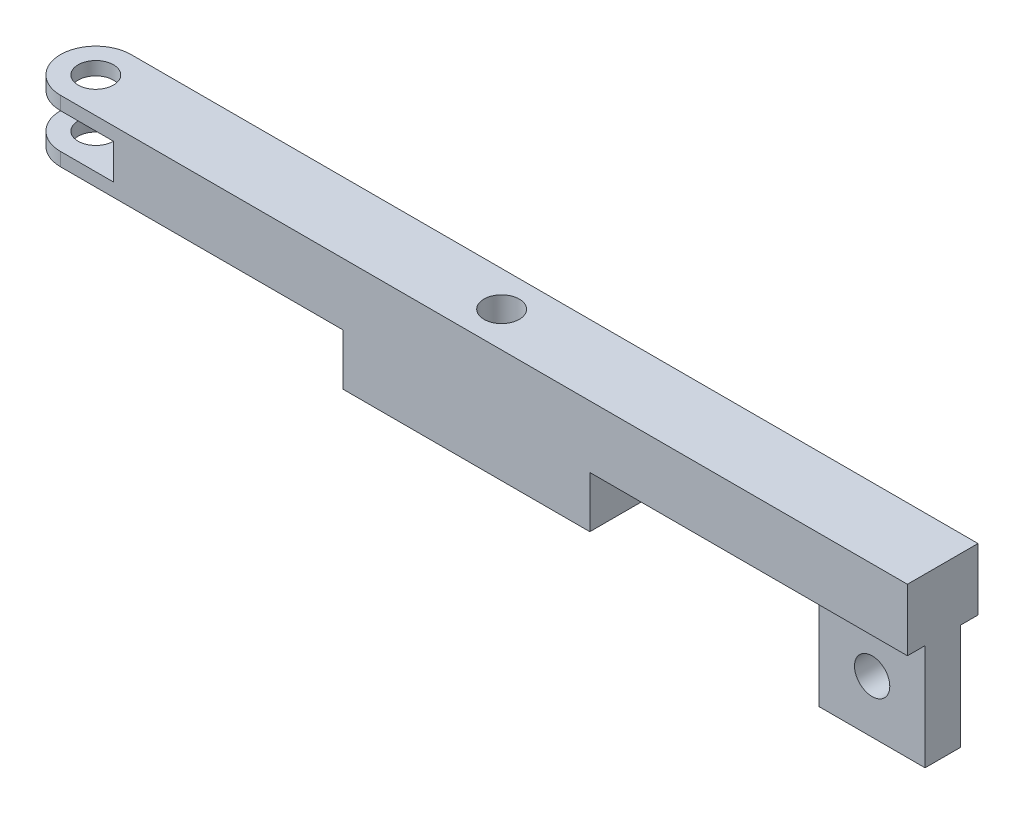
ISO-10303-21;
HEADER;
FILE_DESCRIPTION(('STEP AP214'),'2;1');
FILE_NAME('part.step','',(''),(''),'','','');
FILE_SCHEMA(('AUTOMOTIVE_DESIGN { 1 0 10303 214 1 1 1 1 }'));
ENDSEC;
DATA;
#1=APPLICATION_CONTEXT('core data for automotive mechanical design processes');
#2=APPLICATION_PROTOCOL_DEFINITION('international standard','automotive_design',2000,#1);
#3=PRODUCT_CONTEXT('',#1,'mechanical');
#4=PRODUCT('Part','Part','',(#3));
#5=PRODUCT_RELATED_PRODUCT_CATEGORY('part','',(#4));
#6=PRODUCT_DEFINITION_FORMATION('','',#4);
#7=PRODUCT_DEFINITION_CONTEXT('part definition',#1,'design');
#8=PRODUCT_DEFINITION('design','',#6,#7);
#9=PRODUCT_DEFINITION_SHAPE('','',#8);
#10=(LENGTH_UNIT() NAMED_UNIT(*) SI_UNIT(.MILLI.,.METRE.));
#11=(NAMED_UNIT(*) PLANE_ANGLE_UNIT() SI_UNIT($,.RADIAN.));
#12=(NAMED_UNIT(*) SI_UNIT($,.STERADIAN.) SOLID_ANGLE_UNIT());
#13=UNCERTAINTY_MEASURE_WITH_UNIT(LENGTH_MEASURE(1.E-05),#10,'distance_accuracy_value','');
#14=(GEOMETRIC_REPRESENTATION_CONTEXT(3) GLOBAL_UNCERTAINTY_ASSIGNED_CONTEXT((#13)) GLOBAL_UNIT_ASSIGNED_CONTEXT((#10,
#11,#12)) REPRESENTATION_CONTEXT('',''));
#15=CARTESIAN_POINT('',(0.,0.,0.));
#16=DIRECTION('',(0.,0.,1.));
#17=DIRECTION('',(1.,0.,0.));
#18=AXIS2_PLACEMENT_3D('',#15,#16,#17);
#19=CARTESIAN_POINT('',(-125.,-8.78,20.));
#20=DIRECTION('',(0.,1.,0.));
#21=DIRECTION('',(0.,0.,1.));
#22=AXIS2_PLACEMENT_3D('',#19,#20,#21);
#23=PLANE('',#22);
#24=DIRECTION('',(-1.,0.,0.));
#25=VECTOR('',#24,1.);
#26=CARTESIAN_POINT('',(125.,-8.78,15.));
#27=LINE('',#26,#25);
#28=CARTESIAN_POINT('',(125.,-8.78,15.));
#29=VERTEX_POINT('',#28);
#30=CARTESIAN_POINT('',(95.,-8.78,15.));
#31=VERTEX_POINT('',#30);
#32=EDGE_CURVE('E407',#29,#31,#27,.T.);
#33=ORIENTED_EDGE('',*,*,#32,.F.);
#34=DIRECTION('',(0.,0.,-1.));
#35=VECTOR('',#34,1.);
#36=CARTESIAN_POINT('',(125.,-8.78,20.));
#37=LINE('',#36,#35);
#38=CARTESIAN_POINT('',(125.,-8.78,20.));
#39=VERTEX_POINT('',#38);
#40=EDGE_CURVE('E185',#39,#29,#37,.T.);
#41=ORIENTED_EDGE('',*,*,#40,.F.);
#42=DIRECTION('',(1.,0.,0.));
#43=VECTOR('',#42,1.);
#44=CARTESIAN_POINT('',(-125.,-8.78,20.));
#45=LINE('',#44,#43);
#46=CARTESIAN_POINT('',(35.,-8.78,20.));
#47=VERTEX_POINT('',#46);
#48=EDGE_CURVE('E261',#47,#39,#45,.T.);
#49=ORIENTED_EDGE('',*,*,#48,.F.);
#50=DIRECTION('',(0.,0.,1.));
#51=VECTOR('',#50,1.);
#52=CARTESIAN_POINT('',(35.,-8.78,0.));
#53=LINE('',#52,#51);
#54=CARTESIAN_POINT('',(35.,-8.78,0.));
#55=VERTEX_POINT('',#54);
#56=EDGE_CURVE('E73',#55,#47,#53,.T.);
#57=ORIENTED_EDGE('',*,*,#56,.F.);
#58=DIRECTION('',(1.,0.,0.));
#59=VECTOR('',#58,1.);
#60=CARTESIAN_POINT('',(-125.,-8.78,0.));
#61=LINE('',#60,#59);
#62=CARTESIAN_POINT('',(125.,-8.78,0.));
#63=VERTEX_POINT('',#62);
#64=EDGE_CURVE('E277',#55,#63,#61,.T.);
#65=ORIENTED_EDGE('',*,*,#64,.T.);
#66=CARTESIAN_POINT('',(125.,-8.78,5.));
#67=VERTEX_POINT('',#66);
#68=EDGE_CURVE('E265',#67,#63,#37,.T.);
#69=ORIENTED_EDGE('',*,*,#68,.F.);
#70=DIRECTION('',(1.,0.,0.));
#71=VECTOR('',#70,1.);
#72=CARTESIAN_POINT('',(125.,-8.78,5.));
#73=LINE('',#72,#71);
#74=CARTESIAN_POINT('',(95.,-8.78,5.));
#75=VERTEX_POINT('',#74);
#76=EDGE_CURVE('E179',#75,#67,#73,.T.);
#77=ORIENTED_EDGE('',*,*,#76,.F.);
#78=DIRECTION('',(0.,0.,-1.));
#79=VECTOR('',#78,1.);
#80=CARTESIAN_POINT('',(95.,-8.78,5.));
#81=LINE('',#80,#79);
#82=EDGE_CURVE('E408',#31,#75,#81,.T.);
#83=ORIENTED_EDGE('',*,*,#82,.F.);
#84=EDGE_LOOP('',(#33,#41,#49,#57,#65,#69,#77,#83));
#85=FACE_BOUND('',#84,.T.);
#86=ADVANCED_FACE('F48',(#85),#23,.F.);
#87=CARTESIAN_POINT('',(-115.,-8.78,9.99999999999999));
#88=DIRECTION('',(0.,1.,0.));
#89=DIRECTION('',(0.,0.,1.));
#90=AXIS2_PLACEMENT_3D('',#87,#88,#89);
#91=CIRCLE('',#90,4.99999999999999);
#92=CARTESIAN_POINT('',(-115.,-8.78,15.));
#93=VERTEX_POINT('',#92);
#94=EDGE_CURVE('E222',#93,#93,#91,.T.);
#95=ORIENTED_EDGE('',*,*,#94,.T.);
#96=EDGE_LOOP('',(#95));
#97=FACE_BOUND('',#96,.T.);
#98=DIRECTION('',(0.,0.,-1.));
#99=VECTOR('',#98,1.);
#100=CARTESIAN_POINT('',(-35.,-8.78,0.));
#101=LINE('',#100,#99);
#102=CARTESIAN_POINT('',(-35.,-8.78,20.));
#103=VERTEX_POINT('',#102);
#104=CARTESIAN_POINT('',(-35.,-8.78,0.));
#105=VERTEX_POINT('',#104);
#106=EDGE_CURVE('E198',#103,#105,#101,.T.);
#107=ORIENTED_EDGE('',*,*,#106,.F.);
#108=CARTESIAN_POINT('',(-115.,-8.78,20.));
#109=VERTEX_POINT('',#108);
#110=EDGE_CURVE('E262',#109,#103,#45,.T.);
#111=ORIENTED_EDGE('',*,*,#110,.F.);
#112=CARTESIAN_POINT('',(-115.,-8.78,9.99999999999999));
#113=DIRECTION('',(0.,1.,0.));
#114=DIRECTION('',(0.,0.,1.));
#115=AXIS2_PLACEMENT_3D('',#112,#113,#114);
#116=CIRCLE('',#115,10.);
#117=CARTESIAN_POINT('',(-115.,-8.78,0.));
#118=VERTEX_POINT('',#117);
#119=EDGE_CURVE('E236',#109,#118,#116,.F.);
#120=ORIENTED_EDGE('',*,*,#119,.T.);
#121=EDGE_CURVE('E251',#118,#105,#61,.T.);
#122=ORIENTED_EDGE('',*,*,#121,.T.);
#123=EDGE_LOOP('',(#107,#111,#120,#122));
#124=FACE_BOUND('',#123,.T.);
#125=ADVANCED_FACE('F291',(#97,#124),#23,.F.);
#126=CARTESIAN_POINT('',(-125.,8.78,20.));
#127=DIRECTION('',(0.,-1.,0.));
#128=DIRECTION('',(0.,0.,-1.));
#129=AXIS2_PLACEMENT_3D('',#126,#127,#128);
#130=PLANE('',#129);
#131=CARTESIAN_POINT('',(-115.,8.78,9.99999999999999));
#132=DIRECTION('',(0.,-1.,0.));
#133=DIRECTION('',(0.,0.,-1.));
#134=AXIS2_PLACEMENT_3D('',#131,#132,#133);
#135=CIRCLE('',#134,4.99999999999999);
#136=CARTESIAN_POINT('',(-115.,8.78,5.));
#137=VERTEX_POINT('',#136);
#138=EDGE_CURVE('E229',#137,#137,#135,.T.);
#139=ORIENTED_EDGE('',*,*,#138,.T.);
#140=EDGE_LOOP('',(#139));
#141=FACE_BOUND('',#140,.T.);
#142=CARTESIAN_POINT('',(0.,8.78,10.));
#143=DIRECTION('',(0.,-1.,0.));
#144=DIRECTION('',(0.,0.,-1.));
#145=AXIS2_PLACEMENT_3D('',#142,#143,#144);
#146=CIRCLE('',#145,5.);
#147=CARTESIAN_POINT('',(0.,8.78,5.00000000000003));
#148=VERTEX_POINT('',#147);
#149=EDGE_CURVE('E219',#148,#148,#146,.T.);
#150=ORIENTED_EDGE('',*,*,#149,.T.);
#151=EDGE_LOOP('',(#150));
#152=FACE_BOUND('',#151,.T.);
#153=DIRECTION('',(-1.,0.,0.));
#154=VECTOR('',#153,1.);
#155=CARTESIAN_POINT('',(-125.,8.78,0.));
#156=LINE('',#155,#154);
#157=CARTESIAN_POINT('',(125.,8.78,0.));
#158=VERTEX_POINT('',#157);
#159=CARTESIAN_POINT('',(-115.,8.78,0.));
#160=VERTEX_POINT('',#159);
#161=EDGE_CURVE('E267',#158,#160,#156,.T.);
#162=ORIENTED_EDGE('',*,*,#161,.T.);
#163=CARTESIAN_POINT('',(-115.,8.78,9.99999999999999));
#164=DIRECTION('',(0.,-1.,0.));
#165=DIRECTION('',(0.,0.,-1.));
#166=AXIS2_PLACEMENT_3D('',#163,#164,#165);
#167=CIRCLE('',#166,10.);
#168=CARTESIAN_POINT('',(-115.,8.78,20.));
#169=VERTEX_POINT('',#168);
#170=EDGE_CURVE('E244',#160,#169,#167,.F.);
#171=ORIENTED_EDGE('',*,*,#170,.T.);
#172=DIRECTION('',(-1.,0.,0.));
#173=VECTOR('',#172,1.);
#174=CARTESIAN_POINT('',(-125.,8.78,20.));
#175=LINE('',#174,#173);
#176=CARTESIAN_POINT('',(125.,8.78,20.));
#177=VERTEX_POINT('',#176);
#178=EDGE_CURVE('E250',#177,#169,#175,.T.);
#179=ORIENTED_EDGE('',*,*,#178,.F.);
#180=DIRECTION('',(0.,0.,-1.));
#181=VECTOR('',#180,1.);
#182=CARTESIAN_POINT('',(125.,8.78,20.));
#183=LINE('',#182,#181);
#184=EDGE_CURVE('E286',#177,#158,#183,.T.);
#185=ORIENTED_EDGE('',*,*,#184,.T.);
#186=EDGE_LOOP('',(#162,#171,#179,#185));
#187=FACE_BOUND('',#186,.T.);
#188=ADVANCED_FACE('F343',(#141,#152,#187),#130,.F.);
#189=CARTESIAN_POINT('',(-125.,5.,20.));
#190=DIRECTION('',(0.,1.,0.));
#191=DIRECTION('',(0.,0.,1.));
#192=AXIS2_PLACEMENT_3D('',#189,#190,#191);
#193=PLANE('',#192);
#194=CARTESIAN_POINT('',(-115.,5.,9.99999999999999));
#195=DIRECTION('',(0.,1.,0.));
#196=DIRECTION('',(0.,0.,1.));
#197=AXIS2_PLACEMENT_3D('',#194,#195,#196);
#198=CIRCLE('',#197,4.99999999999999);
#199=CARTESIAN_POINT('',(-115.,5.,15.));
#200=VERTEX_POINT('',#199);
#201=EDGE_CURVE('E226',#200,#200,#198,.T.);
#202=ORIENTED_EDGE('',*,*,#201,.T.);
#203=EDGE_LOOP('',(#202));
#204=FACE_BOUND('',#203,.T.);
#205=DIRECTION('',(1.,0.,0.));
#206=VECTOR('',#205,1.);
#207=CARTESIAN_POINT('',(-125.,5.,20.));
#208=LINE('',#207,#206);
#209=CARTESIAN_POINT('',(-115.,5.,20.));
#210=VERTEX_POINT('',#209);
#211=CARTESIAN_POINT('',(-100.,5.,20.));
#212=VERTEX_POINT('',#211);
#213=EDGE_CURVE('E254',#210,#212,#208,.T.);
#214=ORIENTED_EDGE('',*,*,#213,.F.);
#215=CARTESIAN_POINT('',(-115.,5.,9.99999999999999));
#216=DIRECTION('',(0.,1.,0.));
#217=DIRECTION('',(0.,0.,1.));
#218=AXIS2_PLACEMENT_3D('',#215,#216,#217);
#219=CIRCLE('',#218,10.);
#220=CARTESIAN_POINT('',(-115.,5.,0.));
#221=VERTEX_POINT('',#220);
#222=EDGE_CURVE('E241',#210,#221,#219,.F.);
#223=ORIENTED_EDGE('',*,*,#222,.T.);
#224=DIRECTION('',(1.,0.,0.));
#225=VECTOR('',#224,1.);
#226=CARTESIAN_POINT('',(-125.,5.,0.));
#227=LINE('',#226,#225);
#228=CARTESIAN_POINT('',(-100.,5.,0.));
#229=VERTEX_POINT('',#228);
#230=EDGE_CURVE('E270',#221,#229,#227,.T.);
#231=ORIENTED_EDGE('',*,*,#230,.T.);
#232=DIRECTION('',(0.,0.,-1.));
#233=VECTOR('',#232,1.);
#234=CARTESIAN_POINT('',(-100.,5.,20.));
#235=LINE('',#234,#233);
#236=EDGE_CURVE('E283',#212,#229,#235,.T.);
#237=ORIENTED_EDGE('',*,*,#236,.F.);
#238=EDGE_LOOP('',(#214,#223,#231,#237));
#239=FACE_BOUND('',#238,.T.);
#240=ADVANCED_FACE('F306',(#204,#239),#193,.F.);
#241=CARTESIAN_POINT('',(-125.,-5.,20.));
#242=DIRECTION('',(0.,-1.,0.));
#243=DIRECTION('',(0.,0.,-1.));
#244=AXIS2_PLACEMENT_3D('',#241,#242,#243);
#245=PLANE('',#244);
#246=CARTESIAN_POINT('',(-115.,-5.,9.99999999999999));
#247=DIRECTION('',(0.,-1.,0.));
#248=DIRECTION('',(0.,0.,-1.));
#249=AXIS2_PLACEMENT_3D('',#246,#247,#248);
#250=CIRCLE('',#249,4.99999999999999);
#251=CARTESIAN_POINT('',(-115.,-5.,5.));
#252=VERTEX_POINT('',#251);
#253=EDGE_CURVE('E223',#252,#252,#250,.T.);
#254=ORIENTED_EDGE('',*,*,#253,.T.);
#255=EDGE_LOOP('',(#254));
#256=FACE_BOUND('',#255,.T.);
#257=DIRECTION('',(-1.,0.,0.));
#258=VECTOR('',#257,1.);
#259=CARTESIAN_POINT('',(-125.,-5.,0.));
#260=LINE('',#259,#258);
#261=CARTESIAN_POINT('',(-100.,-5.,0.));
#262=VERTEX_POINT('',#261);
#263=CARTESIAN_POINT('',(-115.,-5.,0.));
#264=VERTEX_POINT('',#263);
#265=EDGE_CURVE('E274',#262,#264,#260,.T.);
#266=ORIENTED_EDGE('',*,*,#265,.T.);
#267=CARTESIAN_POINT('',(-115.,-5.,9.99999999999999));
#268=DIRECTION('',(0.,-1.,0.));
#269=DIRECTION('',(0.,0.,-1.));
#270=AXIS2_PLACEMENT_3D('',#267,#268,#269);
#271=CIRCLE('',#270,10.);
#272=CARTESIAN_POINT('',(-115.,-5.,20.));
#273=VERTEX_POINT('',#272);
#274=EDGE_CURVE('E239',#264,#273,#271,.F.);
#275=ORIENTED_EDGE('',*,*,#274,.T.);
#276=DIRECTION('',(-1.,0.,0.));
#277=VECTOR('',#276,1.);
#278=CARTESIAN_POINT('',(-125.,-5.,20.));
#279=LINE('',#278,#277);
#280=CARTESIAN_POINT('',(-100.,-5.,20.));
#281=VERTEX_POINT('',#280);
#282=EDGE_CURVE('E258',#281,#273,#279,.T.);
#283=ORIENTED_EDGE('',*,*,#282,.F.);
#284=DIRECTION('',(0.,0.,-1.));
#285=VECTOR('',#284,1.);
#286=CARTESIAN_POINT('',(-100.,-5.,20.));
#287=LINE('',#286,#285);
#288=EDGE_CURVE('E280',#281,#262,#287,.T.);
#289=ORIENTED_EDGE('',*,*,#288,.T.);
#290=EDGE_LOOP('',(#266,#275,#283,#289));
#291=FACE_BOUND('',#290,.T.);
#292=ADVANCED_FACE('F302',(#256,#291),#245,.F.);
#293=CARTESIAN_POINT('',(0.,0.,20.));
#294=DIRECTION('',(0.,0.,-1.));
#295=DIRECTION('',(-1.,0.,0.));
#296=AXIS2_PLACEMENT_3D('',#293,#294,#295);
#297=PLANE('',#296);
#298=DIRECTION('',(0.,-1.,0.));
#299=VECTOR('',#298,1.);
#300=CARTESIAN_POINT('',(-115.,25.,20.));
#301=LINE('',#300,#299);
#302=EDGE_CURVE('E232',#273,#109,#301,.T.);
#303=ORIENTED_EDGE('',*,*,#302,.T.);
#304=ORIENTED_EDGE('',*,*,#110,.T.);
#305=DIRECTION('',(0.,1.,0.));
#306=VECTOR('',#305,1.);
#307=CARTESIAN_POINT('',(-35.,-23.33,20.));
#308=LINE('',#307,#306);
#309=CARTESIAN_POINT('',(-35.,-23.33,20.));
#310=VERTEX_POINT('',#309);
#311=EDGE_CURVE('E213',#310,#103,#308,.T.);
#312=ORIENTED_EDGE('',*,*,#311,.F.);
#313=DIRECTION('',(-1.,0.,0.));
#314=VECTOR('',#313,1.);
#315=CARTESIAN_POINT('',(-35.,-23.33,20.));
#316=LINE('',#315,#314);
#317=CARTESIAN_POINT('',(35.,-23.33,20.));
#318=VERTEX_POINT('',#317);
#319=EDGE_CURVE('E197',#318,#310,#316,.T.);
#320=ORIENTED_EDGE('',*,*,#319,.F.);
#321=DIRECTION('',(0.,1.,0.));
#322=VECTOR('',#321,1.);
#323=CARTESIAN_POINT('',(35.,-23.33,20.));
#324=LINE('',#323,#322);
#325=EDGE_CURVE('E216',#318,#47,#324,.T.);
#326=ORIENTED_EDGE('',*,*,#325,.T.);
#327=ORIENTED_EDGE('',*,*,#48,.T.);
#328=DIRECTION('',(0.,1.,0.));
#329=VECTOR('',#328,1.);
#330=CARTESIAN_POINT('',(125.,-8.78,20.));
#331=LINE('',#330,#329);
#332=EDGE_CURVE('E247',#39,#177,#331,.T.);
#333=ORIENTED_EDGE('',*,*,#332,.T.);
#334=ORIENTED_EDGE('',*,*,#178,.T.);
#335=EDGE_CURVE('E235',#169,#210,#301,.T.);
#336=ORIENTED_EDGE('',*,*,#335,.T.);
#337=ORIENTED_EDGE('',*,*,#213,.T.);
#338=DIRECTION('',(0.,-1.,0.));
#339=VECTOR('',#338,1.);
#340=CARTESIAN_POINT('',(-100.,-5.,20.));
#341=LINE('',#340,#339);
#342=EDGE_CURVE('E256',#212,#281,#341,.T.);
#343=ORIENTED_EDGE('',*,*,#342,.T.);
#344=ORIENTED_EDGE('',*,*,#282,.T.);
#345=EDGE_LOOP('',(#303,#304,#312,#320,#326,#327,#333,#334,#336,#337,#343,#344));
#346=FACE_BOUND('',#345,.T.);
#347=ADVANCED_FACE('F305',(#346),#297,.F.);
#348=CARTESIAN_POINT('',(125.,-8.78,20.));
#349=DIRECTION('',(-1.,0.,0.));
#350=DIRECTION('',(0.,0.,1.));
#351=AXIS2_PLACEMENT_3D('',#348,#349,#350);
#352=PLANE('',#351);
#353=DIRECTION('',(0.,1.,0.));
#354=VECTOR('',#353,1.);
#355=CARTESIAN_POINT('',(125.,-8.78,0.));
#356=LINE('',#355,#354);
#357=EDGE_CURVE('E246',#63,#158,#356,.T.);
#358=ORIENTED_EDGE('',*,*,#357,.T.);
#359=ORIENTED_EDGE('',*,*,#184,.F.);
#360=ORIENTED_EDGE('',*,*,#332,.F.);
#361=ORIENTED_EDGE('',*,*,#40,.T.);
#362=DIRECTION('',(0.,1.,0.));
#363=VECTOR('',#362,1.);
#364=CARTESIAN_POINT('',(125.,-38.78,15.));
#365=LINE('',#364,#363);
#366=CARTESIAN_POINT('',(125.,-38.78,15.));
#367=VERTEX_POINT('',#366);
#368=EDGE_CURVE('E167',#367,#29,#365,.T.);
#369=ORIENTED_EDGE('',*,*,#368,.F.);
#370=DIRECTION('',(0.,0.,1.));
#371=VECTOR('',#370,1.);
#372=CARTESIAN_POINT('',(125.,-38.78,5.));
#373=LINE('',#372,#371);
#374=CARTESIAN_POINT('',(125.,-38.78,5.));
#375=VERTEX_POINT('',#374);
#376=EDGE_CURVE('E174',#375,#367,#373,.T.);
#377=ORIENTED_EDGE('',*,*,#376,.F.);
#378=DIRECTION('',(0.,1.,0.));
#379=VECTOR('',#378,1.);
#380=CARTESIAN_POINT('',(125.,-38.78,5.));
#381=LINE('',#380,#379);
#382=EDGE_CURVE('E65',#375,#67,#381,.T.);
#383=ORIENTED_EDGE('',*,*,#382,.T.);
#384=ORIENTED_EDGE('',*,*,#68,.T.);
#385=EDGE_LOOP('',(#358,#359,#360,#361,#369,#377,#383,#384));
#386=FACE_BOUND('',#385,.T.);
#387=ADVANCED_FACE('F50',(#386),#352,.F.);
#388=CARTESIAN_POINT('',(-100.,-5.,20.));
#389=DIRECTION('',(1.,0.,0.));
#390=DIRECTION('',(0.,0.,-1.));
#391=AXIS2_PLACEMENT_3D('',#388,#389,#390);
#392=PLANE('',#391);
#393=DIRECTION('',(0.,-1.,0.));
#394=VECTOR('',#393,1.);
#395=CARTESIAN_POINT('',(-100.,-5.,0.));
#396=LINE('',#395,#394);
#397=EDGE_CURVE('E272',#229,#262,#396,.T.);
#398=ORIENTED_EDGE('',*,*,#397,.T.);
#399=ORIENTED_EDGE('',*,*,#288,.F.);
#400=ORIENTED_EDGE('',*,*,#342,.F.);
#401=ORIENTED_EDGE('',*,*,#236,.T.);
#402=EDGE_LOOP('',(#398,#399,#400,#401));
#403=FACE_BOUND('',#402,.T.);
#404=ADVANCED_FACE('F352',(#403),#392,.F.);
#405=CARTESIAN_POINT('',(0.,0.,0.));
#406=DIRECTION('',(0.,0.,-1.));
#407=DIRECTION('',(-1.,0.,0.));
#408=AXIS2_PLACEMENT_3D('',#405,#406,#407);
#409=PLANE('',#408);
#410=DIRECTION('',(0.,-1.,0.));
#411=VECTOR('',#410,1.);
#412=CARTESIAN_POINT('',(-115.,0.,0.));
#413=LINE('',#412,#411);
#414=EDGE_CURVE('E13',#160,#221,#413,.T.);
#415=ORIENTED_EDGE('',*,*,#414,.F.);
#416=ORIENTED_EDGE('',*,*,#161,.F.);
#417=ORIENTED_EDGE('',*,*,#357,.F.);
#418=ORIENTED_EDGE('',*,*,#64,.F.);
#419=DIRECTION('',(0.,1.,0.));
#420=VECTOR('',#419,1.);
#421=CARTESIAN_POINT('',(35.,-23.33,0.));
#422=LINE('',#421,#420);
#423=CARTESIAN_POINT('',(35.,-23.33,0.));
#424=VERTEX_POINT('',#423);
#425=EDGE_CURVE('E204',#424,#55,#422,.T.);
#426=ORIENTED_EDGE('',*,*,#425,.F.);
#427=DIRECTION('',(1.,0.,0.));
#428=VECTOR('',#427,1.);
#429=CARTESIAN_POINT('',(-35.,-23.33,0.));
#430=LINE('',#429,#428);
#431=CARTESIAN_POINT('',(-35.,-23.33,0.));
#432=VERTEX_POINT('',#431);
#433=EDGE_CURVE('E202',#432,#424,#430,.T.);
#434=ORIENTED_EDGE('',*,*,#433,.F.);
#435=DIRECTION('',(0.,1.,0.));
#436=VECTOR('',#435,1.);
#437=CARTESIAN_POINT('',(-35.,-23.33,0.));
#438=LINE('',#437,#436);
#439=EDGE_CURVE('E210',#432,#105,#438,.T.);
#440=ORIENTED_EDGE('',*,*,#439,.T.);
#441=ORIENTED_EDGE('',*,*,#121,.F.);
#442=EDGE_CURVE('E57',#264,#118,#413,.T.);
#443=ORIENTED_EDGE('',*,*,#442,.F.);
#444=ORIENTED_EDGE('',*,*,#265,.F.);
#445=ORIENTED_EDGE('',*,*,#397,.F.);
#446=ORIENTED_EDGE('',*,*,#230,.F.);
#447=EDGE_LOOP('',(#415,#416,#417,#418,#426,#434,#440,#441,#443,#444,#445,#446));
#448=FACE_BOUND('',#447,.T.);
#449=ADVANCED_FACE('F316',(#448),#409,.T.);
#450=CARTESIAN_POINT('',(-115.,25.,9.99999999999999));
#451=DIRECTION('',(0.,-1.,0.));
#452=DIRECTION('',(0.,0.,-1.));
#453=AXIS2_PLACEMENT_3D('',#450,#451,#452);
#454=CYLINDRICAL_SURFACE('',#453,10.);
#455=ORIENTED_EDGE('',*,*,#442,.T.);
#456=ORIENTED_EDGE('',*,*,#119,.F.);
#457=ORIENTED_EDGE('',*,*,#302,.F.);
#458=ORIENTED_EDGE('',*,*,#274,.F.);
#459=EDGE_LOOP('',(#455,#456,#457,#458));
#460=FACE_BOUND('',#459,.T.);
#461=ADVANCED_FACE('F320',(#460),#454,.T.);
#462=ORIENTED_EDGE('',*,*,#414,.T.);
#463=ORIENTED_EDGE('',*,*,#222,.F.);
#464=ORIENTED_EDGE('',*,*,#335,.F.);
#465=ORIENTED_EDGE('',*,*,#170,.F.);
#466=EDGE_LOOP('',(#462,#463,#464,#465));
#467=FACE_BOUND('',#466,.T.);
#468=ADVANCED_FACE('F369',(#467),#454,.T.);
#469=CARTESIAN_POINT('',(0.,25.,10.));
#470=DIRECTION('',(0.,-1.,0.));
#471=DIRECTION('',(0.,0.,-1.));
#472=AXIS2_PLACEMENT_3D('',#469,#470,#471);
#473=CYLINDRICAL_SURFACE('',#472,5.);
#474=ORIENTED_EDGE('',*,*,#149,.F.);
#475=EDGE_LOOP('',(#474));
#476=FACE_BOUND('',#475,.T.);
#477=CARTESIAN_POINT('',(0.,-23.33,10.));
#478=DIRECTION('',(0.,-1.,0.));
#479=DIRECTION('',(0.,0.,-1.));
#480=AXIS2_PLACEMENT_3D('',#477,#478,#479);
#481=CIRCLE('',#480,5.);
#482=CARTESIAN_POINT('',(0.,-23.33,5.00000000000003));
#483=VERTEX_POINT('',#482);
#484=EDGE_CURVE('E186',#483,#483,#481,.T.);
#485=ORIENTED_EDGE('',*,*,#484,.T.);
#486=EDGE_LOOP('',(#485));
#487=FACE_BOUND('',#486,.T.);
#488=ADVANCED_FACE('F298',(#476,#487),#473,.F.);
#489=CARTESIAN_POINT('',(-115.,25.,9.99999999999999));
#490=DIRECTION('',(0.,-1.,0.));
#491=DIRECTION('',(0.,0.,-1.));
#492=AXIS2_PLACEMENT_3D('',#489,#490,#491);
#493=CYLINDRICAL_SURFACE('',#492,4.99999999999999);
#494=ORIENTED_EDGE('',*,*,#94,.F.);
#495=EDGE_LOOP('',(#494));
#496=FACE_BOUND('',#495,.T.);
#497=ORIENTED_EDGE('',*,*,#253,.F.);
#498=EDGE_LOOP('',(#497));
#499=FACE_BOUND('',#498,.T.);
#500=ADVANCED_FACE('F294',(#496,#499),#493,.F.);
#501=ORIENTED_EDGE('',*,*,#201,.F.);
#502=EDGE_LOOP('',(#501));
#503=FACE_BOUND('',#502,.T.);
#504=ORIENTED_EDGE('',*,*,#138,.F.);
#505=EDGE_LOOP('',(#504));
#506=FACE_BOUND('',#505,.T.);
#507=ADVANCED_FACE('F297',(#503,#506),#493,.F.);
#508=CARTESIAN_POINT('',(0.,-23.33,0.));
#509=DIRECTION('',(0.,1.,0.));
#510=DIRECTION('',(0.,0.,1.));
#511=AXIS2_PLACEMENT_3D('',#508,#509,#510);
#512=PLANE('',#511);
#513=DIRECTION('',(0.,0.,1.));
#514=VECTOR('',#513,1.);
#515=CARTESIAN_POINT('',(35.,-23.33,0.));
#516=LINE('',#515,#514);
#517=EDGE_CURVE('E194',#424,#318,#516,.T.);
#518=ORIENTED_EDGE('',*,*,#517,.T.);
#519=ORIENTED_EDGE('',*,*,#319,.T.);
#520=DIRECTION('',(0.,0.,-1.));
#521=VECTOR('',#520,1.);
#522=CARTESIAN_POINT('',(-35.,-23.33,0.));
#523=LINE('',#522,#521);
#524=EDGE_CURVE('E200',#310,#432,#523,.T.);
#525=ORIENTED_EDGE('',*,*,#524,.T.);
#526=ORIENTED_EDGE('',*,*,#433,.T.);
#527=EDGE_LOOP('',(#518,#519,#525,#526));
#528=FACE_BOUND('',#527,.T.);
#529=ORIENTED_EDGE('',*,*,#484,.F.);
#530=EDGE_LOOP('',(#529));
#531=FACE_BOUND('',#530,.T.);
#532=ADVANCED_FACE('F330',(#528,#531),#512,.F.);
#533=CARTESIAN_POINT('',(35.,-23.33,0.));
#534=DIRECTION('',(-1.,0.,0.));
#535=DIRECTION('',(0.,0.,1.));
#536=AXIS2_PLACEMENT_3D('',#533,#534,#535);
#537=PLANE('',#536);
#538=ORIENTED_EDGE('',*,*,#56,.T.);
#539=ORIENTED_EDGE('',*,*,#325,.F.);
#540=ORIENTED_EDGE('',*,*,#517,.F.);
#541=ORIENTED_EDGE('',*,*,#425,.T.);
#542=EDGE_LOOP('',(#538,#539,#540,#541));
#543=FACE_BOUND('',#542,.T.);
#544=ADVANCED_FACE('F336',(#543),#537,.F.);
#545=CARTESIAN_POINT('',(-35.,-23.33,0.));
#546=DIRECTION('',(1.,0.,0.));
#547=DIRECTION('',(0.,0.,-1.));
#548=AXIS2_PLACEMENT_3D('',#545,#546,#547);
#549=PLANE('',#548);
#550=ORIENTED_EDGE('',*,*,#106,.T.);
#551=ORIENTED_EDGE('',*,*,#439,.F.);
#552=ORIENTED_EDGE('',*,*,#524,.F.);
#553=ORIENTED_EDGE('',*,*,#311,.T.);
#554=EDGE_LOOP('',(#550,#551,#552,#553));
#555=FACE_BOUND('',#554,.T.);
#556=ADVANCED_FACE('F326',(#555),#549,.F.);
#557=CARTESIAN_POINT('',(125.,-38.78,15.));
#558=DIRECTION('',(0.,0.,-1.));
#559=DIRECTION('',(-1.,0.,0.));
#560=AXIS2_PLACEMENT_3D('',#557,#558,#559);
#561=PLANE('',#560);
#562=CARTESIAN_POINT('',(110.,-23.78,15.));
#563=DIRECTION('',(0.,0.,1.));
#564=DIRECTION('',(1.,0.,0.));
#565=AXIS2_PLACEMENT_3D('',#562,#563,#564);
#566=CIRCLE('',#565,4.99999999999999);
#567=CARTESIAN_POINT('',(115.,-23.78,15.));
#568=VERTEX_POINT('',#567);
#569=EDGE_CURVE('E404',#568,#568,#566,.T.);
#570=ORIENTED_EDGE('',*,*,#569,.F.);
#571=EDGE_LOOP('',(#570));
#572=FACE_BOUND('',#571,.T.);
#573=ORIENTED_EDGE('',*,*,#32,.T.);
#574=DIRECTION('',(0.,1.,0.));
#575=VECTOR('',#574,1.);
#576=CARTESIAN_POINT('',(95.,-38.78,15.));
#577=LINE('',#576,#575);
#578=CARTESIAN_POINT('',(95.,-38.78,15.));
#579=VERTEX_POINT('',#578);
#580=EDGE_CURVE('E170',#579,#31,#577,.T.);
#581=ORIENTED_EDGE('',*,*,#580,.F.);
#582=DIRECTION('',(-1.,0.,0.));
#583=VECTOR('',#582,1.);
#584=CARTESIAN_POINT('',(125.,-38.78,15.));
#585=LINE('',#584,#583);
#586=EDGE_CURVE('E163',#367,#579,#585,.T.);
#587=ORIENTED_EDGE('',*,*,#586,.F.);
#588=ORIENTED_EDGE('',*,*,#368,.T.);
#589=EDGE_LOOP('',(#573,#581,#587,#588));
#590=FACE_BOUND('',#589,.T.);
#591=ADVANCED_FACE('F165',(#572,#590),#561,.F.);
#592=CARTESIAN_POINT('',(95.,-38.78,5.));
#593=DIRECTION('',(1.,0.,0.));
#594=DIRECTION('',(0.,0.,-1.));
#595=AXIS2_PLACEMENT_3D('',#592,#593,#594);
#596=PLANE('',#595);
#597=ORIENTED_EDGE('',*,*,#82,.T.);
#598=DIRECTION('',(0.,1.,0.));
#599=VECTOR('',#598,1.);
#600=CARTESIAN_POINT('',(95.,-38.78,5.));
#601=LINE('',#600,#599);
#602=CARTESIAN_POINT('',(95.,-38.78,5.));
#603=VERTEX_POINT('',#602);
#604=EDGE_CURVE('E190',#603,#75,#601,.T.);
#605=ORIENTED_EDGE('',*,*,#604,.F.);
#606=DIRECTION('',(0.,0.,-1.));
#607=VECTOR('',#606,1.);
#608=CARTESIAN_POINT('',(95.,-38.78,5.));
#609=LINE('',#608,#607);
#610=EDGE_CURVE('E173',#579,#603,#609,.T.);
#611=ORIENTED_EDGE('',*,*,#610,.F.);
#612=ORIENTED_EDGE('',*,*,#580,.T.);
#613=EDGE_LOOP('',(#597,#605,#611,#612));
#614=FACE_BOUND('',#613,.T.);
#615=ADVANCED_FACE('F385',(#614),#596,.F.);
#616=CARTESIAN_POINT('',(125.,-38.78,5.));
#617=DIRECTION('',(0.,0.,1.));
#618=DIRECTION('',(1.,0.,0.));
#619=AXIS2_PLACEMENT_3D('',#616,#617,#618);
#620=PLANE('',#619);
#621=CARTESIAN_POINT('',(110.,-23.78,5.));
#622=DIRECTION('',(0.,0.,1.));
#623=DIRECTION('',(1.,0.,0.));
#624=AXIS2_PLACEMENT_3D('',#621,#622,#623);
#625=CIRCLE('',#624,4.99999999999999);
#626=CARTESIAN_POINT('',(115.,-23.78,5.));
#627=VERTEX_POINT('',#626);
#628=EDGE_CURVE('E52',#627,#627,#625,.T.);
#629=ORIENTED_EDGE('',*,*,#628,.T.);
#630=EDGE_LOOP('',(#629));
#631=FACE_BOUND('',#630,.T.);
#632=ORIENTED_EDGE('',*,*,#76,.T.);
#633=ORIENTED_EDGE('',*,*,#382,.F.);
#634=DIRECTION('',(1.,0.,0.));
#635=VECTOR('',#634,1.);
#636=CARTESIAN_POINT('',(125.,-38.78,5.));
#637=LINE('',#636,#635);
#638=EDGE_CURVE('E178',#603,#375,#637,.T.);
#639=ORIENTED_EDGE('',*,*,#638,.F.);
#640=ORIENTED_EDGE('',*,*,#604,.T.);
#641=EDGE_LOOP('',(#632,#633,#639,#640));
#642=FACE_BOUND('',#641,.T.);
#643=ADVANCED_FACE('F389',(#631,#642),#620,.F.);
#644=CARTESIAN_POINT('',(0.,-38.78,0.));
#645=DIRECTION('',(0.,-1.,0.));
#646=DIRECTION('',(0.,0.,-1.));
#647=AXIS2_PLACEMENT_3D('',#644,#645,#646);
#648=PLANE('',#647);
#649=ORIENTED_EDGE('',*,*,#376,.T.);
#650=ORIENTED_EDGE('',*,*,#586,.T.);
#651=ORIENTED_EDGE('',*,*,#610,.T.);
#652=ORIENTED_EDGE('',*,*,#638,.T.);
#653=EDGE_LOOP('',(#649,#650,#651,#652));
#654=FACE_BOUND('',#653,.T.);
#655=ADVANCED_FACE('F176',(#654),#648,.T.);
#656=CARTESIAN_POINT('',(110.,-23.78,-5.00000000000001));
#657=DIRECTION('',(0.,0.,1.));
#658=DIRECTION('',(1.,0.,0.));
#659=AXIS2_PLACEMENT_3D('',#656,#657,#658);
#660=CYLINDRICAL_SURFACE('',#659,4.99999999999999);
#661=ORIENTED_EDGE('',*,*,#569,.T.);
#662=EDGE_LOOP('',(#661));
#663=FACE_BOUND('',#662,.T.);
#664=ORIENTED_EDGE('',*,*,#628,.F.);
#665=EDGE_LOOP('',(#664));
#666=FACE_BOUND('',#665,.T.);
#667=ADVANCED_FACE('F396',(#663,#666),#660,.F.);
#668=CLOSED_SHELL('',(#86,#125,#188,#240,#292,#347,#387,#404,#449,#461,#468,#488,#500,#507,#532,
#544,#556,#591,#615,#643,#655,#667));
#669=MANIFOLD_SOLID_BREP('B2',#668);
#670=ADVANCED_BREP_SHAPE_REPRESENTATION('',(#18,#669),#14);
#671=SHAPE_DEFINITION_REPRESENTATION(#9,#670);
ENDSEC;
END-ISO-10303-21;
